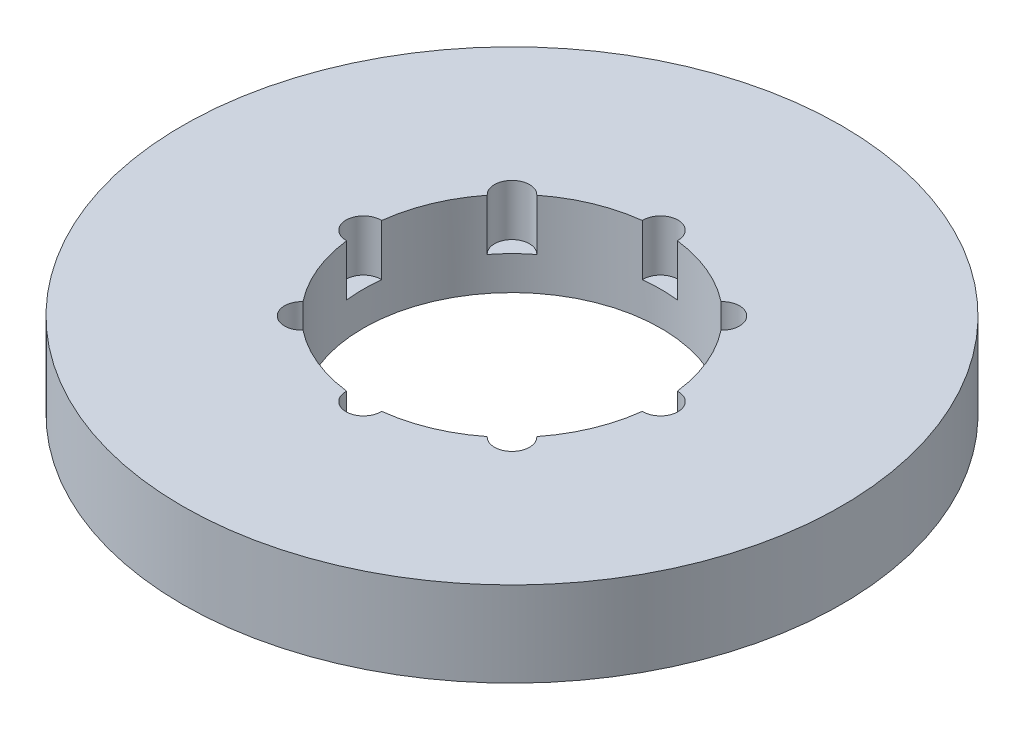
ISO-10303-21;
HEADER;
FILE_DESCRIPTION(('STEP AP214'),'2;1');
FILE_NAME('part.step','',(''),(''),'','','');
FILE_SCHEMA(('AUTOMOTIVE_DESIGN { 1 0 10303 214 1 1 1 1 }'));
ENDSEC;
DATA;
#1=APPLICATION_CONTEXT('core data for automotive mechanical design processes');
#2=APPLICATION_PROTOCOL_DEFINITION('international standard','automotive_design',2000,#1);
#3=PRODUCT_CONTEXT('',#1,'mechanical');
#4=PRODUCT('Part','Part','',(#3));
#5=PRODUCT_RELATED_PRODUCT_CATEGORY('part','',(#4));
#6=PRODUCT_DEFINITION_FORMATION('','',#4);
#7=PRODUCT_DEFINITION_CONTEXT('part definition',#1,'design');
#8=PRODUCT_DEFINITION('design','',#6,#7);
#9=PRODUCT_DEFINITION_SHAPE('','',#8);
#10=(LENGTH_UNIT() NAMED_UNIT(*) SI_UNIT(.MILLI.,.METRE.));
#11=(NAMED_UNIT(*) PLANE_ANGLE_UNIT() SI_UNIT($,.RADIAN.));
#12=(NAMED_UNIT(*) SI_UNIT($,.STERADIAN.) SOLID_ANGLE_UNIT());
#13=UNCERTAINTY_MEASURE_WITH_UNIT(LENGTH_MEASURE(1.E-05),#10,'distance_accuracy_value','');
#14=(GEOMETRIC_REPRESENTATION_CONTEXT(3) GLOBAL_UNCERTAINTY_ASSIGNED_CONTEXT((#13)) GLOBAL_UNIT_ASSIGNED_CONTEXT((#10,
#11,#12)) REPRESENTATION_CONTEXT('',''));
#15=CARTESIAN_POINT('',(0.,0.,0.));
#16=DIRECTION('',(0.,0.,1.));
#17=DIRECTION('',(1.,0.,0.));
#18=AXIS2_PLACEMENT_3D('',#15,#16,#17);
#19=CARTESIAN_POINT('',(0.,20.,0.));
#20=DIRECTION('',(0.,-1.,0.));
#21=DIRECTION('',(0.,0.,-1.));
#22=AXIS2_PLACEMENT_3D('',#19,#20,#21);
#23=CYLINDRICAL_SURFACE('',#22,77.5);
#24=CARTESIAN_POINT('',(0.,20.,0.));
#25=DIRECTION('',(0.,1.,0.));
#26=DIRECTION('',(0.,0.,1.));
#27=AXIS2_PLACEMENT_3D('',#24,#25,#26);
#28=CIRCLE('',#27,77.5);
#29=CARTESIAN_POINT('',(0.,20.,77.5));
#30=VERTEX_POINT('',#29);
#31=EDGE_CURVE('E195',#30,#30,#28,.T.);
#32=ORIENTED_EDGE('',*,*,#31,.F.);
#33=EDGE_LOOP('',(#32));
#34=FACE_BOUND('',#33,.T.);
#35=CARTESIAN_POINT('',(0.,0.,0.));
#36=DIRECTION('',(0.,1.,0.));
#37=DIRECTION('',(0.,0.,1.));
#38=AXIS2_PLACEMENT_3D('',#35,#36,#37);
#39=CIRCLE('',#38,77.5);
#40=CARTESIAN_POINT('',(0.,0.,77.5));
#41=VERTEX_POINT('',#40);
#42=EDGE_CURVE('E179',#41,#41,#39,.T.);
#43=ORIENTED_EDGE('',*,*,#42,.T.);
#44=EDGE_LOOP('',(#43));
#45=FACE_BOUND('',#44,.T.);
#46=ADVANCED_FACE('F39',(#34,#45),#23,.T.);
#47=CARTESIAN_POINT('',(0.,20.,0.));
#48=DIRECTION('',(0.,1.,0.));
#49=DIRECTION('',(0.,0.,1.));
#50=AXIS2_PLACEMENT_3D('',#47,#48,#49);
#51=PLANE('',#50);
#52=CARTESIAN_POINT('',(1.21893159481302E-13,20.,34.9115884210025));
#53=DIRECTION('',(0.,1.,0.));
#54=DIRECTION('',(1.,0.,0.));
#55=AXIS2_PLACEMENT_3D('',#52,#53,#54);
#56=CIRCLE('',#55,4.1246227369542);
#57=CARTESIAN_POINT('',(-4.12170451082952,20.,34.7564605782207));
#58=VERTEX_POINT('',#57);
#59=CARTESIAN_POINT('',(4.12170451082976,20.,34.7564605782207));
#60=VERTEX_POINT('',#59);
#61=EDGE_CURVE('E176',#58,#60,#56,.T.);
#62=ORIENTED_EDGE('',*,*,#61,.F.);
#63=CARTESIAN_POINT('',(0.,20.,0.));
#64=DIRECTION('',(0.,1.,0.));
#65=DIRECTION('',(0.,0.,1.));
#66=AXIS2_PLACEMENT_3D('',#63,#64,#65);
#67=CIRCLE('',#66,35.);
#68=CARTESIAN_POINT('',(-21.6620437552479,20.,27.4910141745576));
#69=VERTEX_POINT('',#68);
#70=EDGE_CURVE('E166',#69,#58,#67,.T.);
#71=ORIENTED_EDGE('',*,*,#70,.F.);
#72=CARTESIAN_POINT('',(-24.6862209144846,20.,24.6862209144847));
#73=DIRECTION('',(0.,1.,0.));
#74=DIRECTION('',(0.707106781186549,0.,0.707106781186546));
#75=AXIS2_PLACEMENT_3D('',#72,#73,#74);
#76=CIRCLE('',#75,4.1246227369542);
#77=CARTESIAN_POINT('',(-27.4910141745575,20.,21.662043755248));
#78=VERTEX_POINT('',#77);
#79=EDGE_CURVE('E147',#78,#69,#76,.T.);
#80=ORIENTED_EDGE('',*,*,#79,.F.);
#81=CARTESIAN_POINT('',(-34.7564605782207,20.,4.12170451082964));
#82=VERTEX_POINT('',#81);
#83=EDGE_CURVE('E180',#82,#78,#67,.T.);
#84=ORIENTED_EDGE('',*,*,#83,.F.);
#85=CARTESIAN_POINT('',(-34.9115884210025,20.,0.));
#86=DIRECTION('',(0.,1.,0.));
#87=DIRECTION('',(0.,0.,1.));
#88=AXIS2_PLACEMENT_3D('',#85,#86,#87);
#89=CIRCLE('',#88,4.1246227369542);
#90=CARTESIAN_POINT('',(-34.7564605782207,20.,-4.12170451082964));
#91=VERTEX_POINT('',#90);
#92=EDGE_CURVE('E186',#91,#82,#89,.T.);
#93=ORIENTED_EDGE('',*,*,#92,.F.);
#94=CARTESIAN_POINT('',(-27.4910141745578,20.,-21.6620437552476));
#95=VERTEX_POINT('',#94);
#96=EDGE_CURVE('E182',#95,#91,#67,.T.);
#97=ORIENTED_EDGE('',*,*,#96,.F.);
#98=CARTESIAN_POINT('',(-24.6862209144849,20.,-24.6862209144843));
#99=DIRECTION('',(0.,1.,0.));
#100=DIRECTION('',(-0.707106781186539,0.,0.707106781186556));
#101=AXIS2_PLACEMENT_3D('',#98,#99,#100);
#102=CIRCLE('',#101,4.1246227369542);
#103=CARTESIAN_POINT('',(-21.6620437552483,20.,-27.4910141745573));
#104=VERTEX_POINT('',#103);
#105=EDGE_CURVE('E446',#104,#95,#102,.T.);
#106=ORIENTED_EDGE('',*,*,#105,.F.);
#107=CARTESIAN_POINT('',(-4.12170451083001,20.,-34.7564605782206));
#108=VERTEX_POINT('',#107);
#109=EDGE_CURVE('E452',#108,#104,#67,.T.);
#110=ORIENTED_EDGE('',*,*,#109,.F.);
#111=CARTESIAN_POINT('',(-3.65679478443907E-13,20.,-34.9115884210025));
#112=DIRECTION('',(0.,1.,0.));
#113=DIRECTION('',(-1.,0.,0.));
#114=AXIS2_PLACEMENT_3D('',#111,#112,#113);
#115=CIRCLE('',#114,4.1246227369542);
#116=CARTESIAN_POINT('',(4.12170451082928,20.,-34.7564605782207));
#117=VERTEX_POINT('',#116);
#118=EDGE_CURVE('E477',#117,#108,#115,.T.);
#119=ORIENTED_EDGE('',*,*,#118,.F.);
#120=CARTESIAN_POINT('',(21.6620437552477,20.,-27.4910141745578));
#121=VERTEX_POINT('',#120);
#122=EDGE_CURVE('E460',#121,#117,#67,.T.);
#123=ORIENTED_EDGE('',*,*,#122,.F.);
#124=CARTESIAN_POINT('',(24.6862209144844,20.,-24.6862209144848));
#125=DIRECTION('',(0.,1.,0.));
#126=DIRECTION('',(-0.707106781186554,0.,-0.707106781186541));
#127=AXIS2_PLACEMENT_3D('',#124,#125,#126);
#128=CIRCLE('',#127,4.1246227369542);
#129=CARTESIAN_POINT('',(27.4910141745574,20.,-21.6620437552482));
#130=VERTEX_POINT('',#129);
#131=EDGE_CURVE('E464',#130,#121,#128,.T.);
#132=ORIENTED_EDGE('',*,*,#131,.F.);
#133=CARTESIAN_POINT('',(34.7564605782207,20.,-4.12170451082964));
#134=VERTEX_POINT('',#133);
#135=EDGE_CURVE('E459',#134,#130,#67,.T.);
#136=ORIENTED_EDGE('',*,*,#135,.F.);
#137=CARTESIAN_POINT('',(34.9115884210025,20.,0.));
#138=DIRECTION('',(0.,1.,0.));
#139=DIRECTION('',(0.,0.,-1.));
#140=AXIS2_PLACEMENT_3D('',#137,#138,#139);
#141=CIRCLE('',#140,4.1246227369542);
#142=CARTESIAN_POINT('',(34.7564605782207,20.,4.12170451082964));
#143=VERTEX_POINT('',#142);
#144=EDGE_CURVE('E469',#143,#134,#141,.T.);
#145=ORIENTED_EDGE('',*,*,#144,.F.);
#146=CARTESIAN_POINT('',(27.4910141745577,20.,21.6620437552478));
#147=VERTEX_POINT('',#146);
#148=EDGE_CURVE('E181',#147,#143,#67,.T.);
#149=ORIENTED_EDGE('',*,*,#148,.F.);
#150=CARTESIAN_POINT('',(24.6862209144847,20.,24.6862209144845));
#151=DIRECTION('',(0.,1.,0.));
#152=DIRECTION('',(0.707106781186544,0.,-0.707106781186551));
#153=AXIS2_PLACEMENT_3D('',#150,#151,#152);
#154=CIRCLE('',#153,4.1246227369542);
#155=CARTESIAN_POINT('',(21.6620437552481,20.,27.4910141745575));
#156=VERTEX_POINT('',#155);
#157=EDGE_CURVE('E475',#156,#147,#154,.T.);
#158=ORIENTED_EDGE('',*,*,#157,.F.);
#159=EDGE_CURVE('E177',#60,#156,#67,.T.);
#160=ORIENTED_EDGE('',*,*,#159,.F.);
#161=EDGE_LOOP('',(#62,#71,#80,#84,#93,#97,#106,#110,#119,#123,#132,#136,#145,#149,#158,#160));
#162=FACE_BOUND('',#161,.T.);
#163=ORIENTED_EDGE('',*,*,#31,.T.);
#164=EDGE_LOOP('',(#163));
#165=FACE_BOUND('',#164,.T.);
#166=ADVANCED_FACE('F172',(#162,#165),#51,.T.);
#167=CARTESIAN_POINT('',(0.,0.,0.));
#168=DIRECTION('',(0.,1.,0.));
#169=DIRECTION('',(0.,0.,1.));
#170=AXIS2_PLACEMENT_3D('',#167,#168,#169);
#171=PLANE('',#170);
#172=CARTESIAN_POINT('',(0.,0.,0.));
#173=DIRECTION('',(0.,1.,0.));
#174=DIRECTION('',(0.,0.,1.));
#175=AXIS2_PLACEMENT_3D('',#172,#173,#174);
#176=CIRCLE('',#175,35.);
#177=CARTESIAN_POINT('',(0.,0.,35.));
#178=VERTEX_POINT('',#177);
#179=EDGE_CURVE('E187',#178,#178,#176,.T.);
#180=ORIENTED_EDGE('',*,*,#179,.T.);
#181=EDGE_LOOP('',(#180));
#182=FACE_BOUND('',#181,.T.);
#183=ORIENTED_EDGE('',*,*,#42,.F.);
#184=EDGE_LOOP('',(#183));
#185=FACE_BOUND('',#184,.T.);
#186=ADVANCED_FACE('F270',(#182,#185),#171,.F.);
#187=CARTESIAN_POINT('',(0.,20.,0.));
#188=DIRECTION('',(0.,-1.,0.));
#189=DIRECTION('',(0.,0.,-1.));
#190=AXIS2_PLACEMENT_3D('',#187,#188,#189);
#191=CYLINDRICAL_SURFACE('',#190,35.);
#192=DIRECTION('',(0.,1.,0.));
#193=VECTOR('',#192,1.);
#194=CARTESIAN_POINT('',(-4.12170451082952,13.9682548965956,34.7564605782207));
#195=LINE('',#194,#193);
#196=CARTESIAN_POINT('',(-4.12170451082952,7.93650979319126,34.7564605782207));
#197=VERTEX_POINT('',#196);
#198=EDGE_CURVE('E11',#197,#58,#195,.T.);
#199=ORIENTED_EDGE('',*,*,#198,.F.);
#200=CARTESIAN_POINT('',(0.,7.93650979319126,0.));
#201=DIRECTION('',(0.,1.,0.));
#202=DIRECTION('',(0.,0.,1.));
#203=AXIS2_PLACEMENT_3D('',#200,#201,#202);
#204=CIRCLE('',#203,35.);
#205=CARTESIAN_POINT('',(4.12170451082976,7.93650979319126,34.7564605782207));
#206=VERTEX_POINT('',#205);
#207=EDGE_CURVE('E250',#197,#206,#204,.T.);
#208=ORIENTED_EDGE('',*,*,#207,.T.);
#209=DIRECTION('',(0.,1.,0.));
#210=VECTOR('',#209,1.);
#211=CARTESIAN_POINT('',(4.12170451082976,13.9682548965956,34.7564605782207));
#212=LINE('',#211,#210);
#213=EDGE_CURVE('E46',#60,#206,#212,.F.);
#214=ORIENTED_EDGE('',*,*,#213,.F.);
#215=ORIENTED_EDGE('',*,*,#159,.T.);
#216=DIRECTION('',(0.,1.,0.));
#217=VECTOR('',#216,1.);
#218=CARTESIAN_POINT('',(21.6620437552481,13.9682548965956,27.4910141745575));
#219=LINE('',#218,#217);
#220=CARTESIAN_POINT('',(21.6620437552481,7.93650979319126,27.4910141745575));
#221=VERTEX_POINT('',#220);
#222=EDGE_CURVE('E244',#221,#156,#219,.T.);
#223=ORIENTED_EDGE('',*,*,#222,.F.);
#224=CARTESIAN_POINT('',(0.,7.93650979319126,0.));
#225=DIRECTION('',(0.,1.,0.));
#226=DIRECTION('',(0.,0.,1.));
#227=AXIS2_PLACEMENT_3D('',#224,#225,#226);
#228=CIRCLE('',#227,35.);
#229=CARTESIAN_POINT('',(27.4910141745577,7.93650979319126,21.6620437552478));
#230=VERTEX_POINT('',#229);
#231=EDGE_CURVE('E238',#221,#230,#228,.T.);
#232=ORIENTED_EDGE('',*,*,#231,.T.);
#233=DIRECTION('',(0.,1.,0.));
#234=VECTOR('',#233,1.);
#235=CARTESIAN_POINT('',(27.4910141745577,13.9682548965956,21.6620437552478));
#236=LINE('',#235,#234);
#237=EDGE_CURVE('E242',#147,#230,#236,.F.);
#238=ORIENTED_EDGE('',*,*,#237,.F.);
#239=ORIENTED_EDGE('',*,*,#148,.T.);
#240=DIRECTION('',(0.,1.,0.));
#241=VECTOR('',#240,1.);
#242=CARTESIAN_POINT('',(34.7564605782207,13.9682548965956,4.12170451082964));
#243=LINE('',#242,#241);
#244=CARTESIAN_POINT('',(34.7564605782207,7.93650979319126,4.12170451082964));
#245=VERTEX_POINT('',#244);
#246=EDGE_CURVE('E236',#245,#143,#243,.T.);
#247=ORIENTED_EDGE('',*,*,#246,.F.);
#248=CARTESIAN_POINT('',(0.,7.93650979319126,0.));
#249=DIRECTION('',(0.,1.,0.));
#250=DIRECTION('',(0.,0.,1.));
#251=AXIS2_PLACEMENT_3D('',#248,#249,#250);
#252=CIRCLE('',#251,35.);
#253=CARTESIAN_POINT('',(34.7564605782207,7.93650979319126,-4.12170451082964));
#254=VERTEX_POINT('',#253);
#255=EDGE_CURVE('E235',#245,#254,#252,.T.);
#256=ORIENTED_EDGE('',*,*,#255,.T.);
#257=DIRECTION('',(0.,1.,0.));
#258=VECTOR('',#257,1.);
#259=CARTESIAN_POINT('',(34.7564605782207,13.9682548965956,-4.12170451082964));
#260=LINE('',#259,#258);
#261=EDGE_CURVE('E234',#134,#254,#260,.F.);
#262=ORIENTED_EDGE('',*,*,#261,.F.);
#263=ORIENTED_EDGE('',*,*,#135,.T.);
#264=DIRECTION('',(0.,1.,0.));
#265=VECTOR('',#264,1.);
#266=CARTESIAN_POINT('',(27.4910141745574,13.9682548965956,-21.6620437552482));
#267=LINE('',#266,#265);
#268=CARTESIAN_POINT('',(27.4910141745574,7.93650979319126,-21.6620437552482));
#269=VERTEX_POINT('',#268);
#270=EDGE_CURVE('E229',#269,#130,#267,.T.);
#271=ORIENTED_EDGE('',*,*,#270,.F.);
#272=CARTESIAN_POINT('',(0.,7.93650979319126,0.));
#273=DIRECTION('',(0.,1.,0.));
#274=DIRECTION('',(0.,0.,1.));
#275=AXIS2_PLACEMENT_3D('',#272,#273,#274);
#276=CIRCLE('',#275,35.);
#277=CARTESIAN_POINT('',(21.6620437552477,7.93650979319126,-27.4910141745578));
#278=VERTEX_POINT('',#277);
#279=EDGE_CURVE('E221',#269,#278,#276,.T.);
#280=ORIENTED_EDGE('',*,*,#279,.T.);
#281=DIRECTION('',(0.,1.,0.));
#282=VECTOR('',#281,1.);
#283=CARTESIAN_POINT('',(21.6620437552477,13.9682548965956,-27.4910141745578));
#284=LINE('',#283,#282);
#285=EDGE_CURVE('E230',#121,#278,#284,.F.);
#286=ORIENTED_EDGE('',*,*,#285,.F.);
#287=ORIENTED_EDGE('',*,*,#122,.T.);
#288=DIRECTION('',(0.,1.,0.));
#289=VECTOR('',#288,1.);
#290=CARTESIAN_POINT('',(4.12170451082928,13.9682548965956,-34.7564605782207));
#291=LINE('',#290,#289);
#292=CARTESIAN_POINT('',(4.12170451082928,7.93650979319126,-34.7564605782207));
#293=VERTEX_POINT('',#292);
#294=EDGE_CURVE('E225',#293,#117,#291,.T.);
#295=ORIENTED_EDGE('',*,*,#294,.F.);
#296=CARTESIAN_POINT('',(0.,7.93650979319126,0.));
#297=DIRECTION('',(0.,1.,0.));
#298=DIRECTION('',(0.,0.,1.));
#299=AXIS2_PLACEMENT_3D('',#296,#297,#298);
#300=CIRCLE('',#299,35.);
#301=CARTESIAN_POINT('',(-4.12170451083001,7.93650979319126,-34.7564605782206));
#302=VERTEX_POINT('',#301);
#303=EDGE_CURVE('E216',#293,#302,#300,.T.);
#304=ORIENTED_EDGE('',*,*,#303,.T.);
#305=DIRECTION('',(0.,1.,0.));
#306=VECTOR('',#305,1.);
#307=CARTESIAN_POINT('',(-4.12170451083001,13.9682548965956,-34.7564605782206));
#308=LINE('',#307,#306);
#309=EDGE_CURVE('E218',#108,#302,#308,.F.);
#310=ORIENTED_EDGE('',*,*,#309,.F.);
#311=ORIENTED_EDGE('',*,*,#109,.T.);
#312=DIRECTION('',(0.,1.,0.));
#313=VECTOR('',#312,1.);
#314=CARTESIAN_POINT('',(-21.6620437552483,13.9682548965956,-27.4910141745573));
#315=LINE('',#314,#313);
#316=CARTESIAN_POINT('',(-21.6620437552483,7.93650979319126,-27.4910141745573));
#317=VERTEX_POINT('',#316);
#318=EDGE_CURVE('E212',#317,#104,#315,.T.);
#319=ORIENTED_EDGE('',*,*,#318,.F.);
#320=CARTESIAN_POINT('',(0.,7.93650979319126,0.));
#321=DIRECTION('',(0.,1.,0.));
#322=DIRECTION('',(0.,0.,1.));
#323=AXIS2_PLACEMENT_3D('',#320,#321,#322);
#324=CIRCLE('',#323,35.);
#325=CARTESIAN_POINT('',(-27.4910141745578,7.93650979319126,-21.6620437552476));
#326=VERTEX_POINT('',#325);
#327=EDGE_CURVE('E208',#317,#326,#324,.T.);
#328=ORIENTED_EDGE('',*,*,#327,.T.);
#329=DIRECTION('',(0.,1.,0.));
#330=VECTOR('',#329,1.);
#331=CARTESIAN_POINT('',(-27.4910141745578,13.9682548965956,-21.6620437552476));
#332=LINE('',#331,#330);
#333=EDGE_CURVE('E211',#95,#326,#332,.F.);
#334=ORIENTED_EDGE('',*,*,#333,.F.);
#335=ORIENTED_EDGE('',*,*,#96,.T.);
#336=DIRECTION('',(0.,1.,0.));
#337=VECTOR('',#336,1.);
#338=CARTESIAN_POINT('',(-34.7564605782207,13.9682548965956,-4.12170451082964));
#339=LINE('',#338,#337);
#340=CARTESIAN_POINT('',(-34.7564605782207,7.93650979319126,-4.12170451082964));
#341=VERTEX_POINT('',#340);
#342=EDGE_CURVE('E201',#341,#91,#339,.T.);
#343=ORIENTED_EDGE('',*,*,#342,.F.);
#344=CARTESIAN_POINT('',(0.,7.93650979319126,0.));
#345=DIRECTION('',(0.,1.,0.));
#346=DIRECTION('',(0.,0.,1.));
#347=AXIS2_PLACEMENT_3D('',#344,#345,#346);
#348=CIRCLE('',#347,35.);
#349=CARTESIAN_POINT('',(-34.7564605782207,7.93650979319126,4.12170451082964));
#350=VERTEX_POINT('',#349);
#351=EDGE_CURVE('E194',#341,#350,#348,.T.);
#352=ORIENTED_EDGE('',*,*,#351,.T.);
#353=DIRECTION('',(0.,1.,0.));
#354=VECTOR('',#353,1.);
#355=CARTESIAN_POINT('',(-34.7564605782207,13.9682548965956,4.12170451082964));
#356=LINE('',#355,#354);
#357=EDGE_CURVE('E199',#82,#350,#356,.F.);
#358=ORIENTED_EDGE('',*,*,#357,.F.);
#359=ORIENTED_EDGE('',*,*,#83,.T.);
#360=DIRECTION('',(0.,1.,0.));
#361=VECTOR('',#360,1.);
#362=CARTESIAN_POINT('',(-27.4910141745575,13.9682548965956,21.662043755248));
#363=LINE('',#362,#361);
#364=CARTESIAN_POINT('',(-27.4910141745575,7.93650979319126,21.662043755248));
#365=VERTEX_POINT('',#364);
#366=EDGE_CURVE('E160',#365,#78,#363,.T.);
#367=ORIENTED_EDGE('',*,*,#366,.F.);
#368=CARTESIAN_POINT('',(0.,7.93650979319126,0.));
#369=DIRECTION('',(0.,1.,0.));
#370=DIRECTION('',(0.,0.,1.));
#371=AXIS2_PLACEMENT_3D('',#368,#369,#370);
#372=CIRCLE('',#371,35.);
#373=CARTESIAN_POINT('',(-21.6620437552479,7.93650979319126,27.4910141745576));
#374=VERTEX_POINT('',#373);
#375=EDGE_CURVE('E168',#365,#374,#372,.T.);
#376=ORIENTED_EDGE('',*,*,#375,.T.);
#377=DIRECTION('',(0.,1.,0.));
#378=VECTOR('',#377,1.);
#379=CARTESIAN_POINT('',(-21.6620437552479,13.9682548965956,27.4910141745576));
#380=LINE('',#379,#378);
#381=EDGE_CURVE('E152',#69,#374,#380,.F.);
#382=ORIENTED_EDGE('',*,*,#381,.F.);
#383=ORIENTED_EDGE('',*,*,#70,.T.);
#384=EDGE_LOOP('',(#199,#208,#214,#215,#223,#232,#238,#239,#247,#256,#262,#263,#271,#280,#286,
#287,#295,#304,#310,#311,#319,#328,#334,#335,#343,#352,#358,#359,#367,#376,#382,#383));
#385=FACE_BOUND('',#384,.T.);
#386=ORIENTED_EDGE('',*,*,#179,.F.);
#387=EDGE_LOOP('',(#386));
#388=FACE_BOUND('',#387,.T.);
#389=ADVANCED_FACE('F170',(#385,#388),#191,.F.);
#390=CARTESIAN_POINT('',(-34.9115884210025,7.93650979319126,0.));
#391=DIRECTION('',(0.,1.,0.));
#392=DIRECTION('',(0.,0.,1.));
#393=AXIS2_PLACEMENT_3D('',#390,#391,#392);
#394=CYLINDRICAL_SURFACE('',#393,4.1246227369542);
#395=ORIENTED_EDGE('',*,*,#342,.T.);
#396=ORIENTED_EDGE('',*,*,#92,.T.);
#397=ORIENTED_EDGE('',*,*,#357,.T.);
#398=CARTESIAN_POINT('',(-34.9115884210025,7.93650979319126,0.));
#399=DIRECTION('',(0.,1.,0.));
#400=DIRECTION('',(0.,0.,1.));
#401=AXIS2_PLACEMENT_3D('',#398,#399,#400);
#402=CIRCLE('',#401,4.1246227369542);
#403=EDGE_CURVE('E191',#341,#350,#402,.T.);
#404=ORIENTED_EDGE('',*,*,#403,.F.);
#405=EDGE_LOOP('',(#395,#396,#397,#404));
#406=FACE_BOUND('',#405,.T.);
#407=ADVANCED_FACE('F279',(#406),#394,.F.);
#408=CARTESIAN_POINT('',(-34.9115884210025,7.93650979319126,0.));
#409=DIRECTION('',(0.,1.,0.));
#410=DIRECTION('',(0.,0.,1.));
#411=AXIS2_PLACEMENT_3D('',#408,#409,#410);
#412=PLANE('',#411);
#413=ORIENTED_EDGE('',*,*,#403,.T.);
#414=ORIENTED_EDGE('',*,*,#351,.F.);
#415=EDGE_LOOP('',(#413,#414));
#416=FACE_BOUND('',#415,.T.);
#417=ADVANCED_FACE('F285',(#416),#412,.T.);
#418=CARTESIAN_POINT('',(-24.6862209144846,7.93650979319126,24.6862209144847));
#419=DIRECTION('',(0.,1.,0.));
#420=DIRECTION('',(0.,0.,1.));
#421=AXIS2_PLACEMENT_3D('',#418,#419,#420);
#422=CYLINDRICAL_SURFACE('',#421,4.1246227369542);
#423=ORIENTED_EDGE('',*,*,#366,.T.);
#424=ORIENTED_EDGE('',*,*,#79,.T.);
#425=ORIENTED_EDGE('',*,*,#381,.T.);
#426=CARTESIAN_POINT('',(-24.6862209144846,7.93650979319126,24.6862209144847));
#427=DIRECTION('',(0.,1.,0.));
#428=DIRECTION('',(0.707106781186549,0.,0.707106781186546));
#429=AXIS2_PLACEMENT_3D('',#426,#427,#428);
#430=CIRCLE('',#429,4.1246227369542);
#431=EDGE_CURVE('E165',#365,#374,#430,.T.);
#432=ORIENTED_EDGE('',*,*,#431,.F.);
#433=EDGE_LOOP('',(#423,#424,#425,#432));
#434=FACE_BOUND('',#433,.T.);
#435=ADVANCED_FACE('F155',(#434),#422,.F.);
#436=CARTESIAN_POINT('',(-24.6862209144846,7.93650979319126,24.6862209144847));
#437=DIRECTION('',(0.,1.,0.));
#438=DIRECTION('',(0.707106781186549,0.,0.707106781186546));
#439=AXIS2_PLACEMENT_3D('',#436,#437,#438);
#440=PLANE('',#439);
#441=ORIENTED_EDGE('',*,*,#431,.T.);
#442=ORIENTED_EDGE('',*,*,#375,.F.);
#443=EDGE_LOOP('',(#441,#442));
#444=FACE_BOUND('',#443,.T.);
#445=ADVANCED_FACE('F288',(#444),#440,.T.);
#446=CARTESIAN_POINT('',(-24.6862209144849,7.93650979319126,-24.6862209144843));
#447=DIRECTION('',(0.,1.,0.));
#448=DIRECTION('',(0.,0.,1.));
#449=AXIS2_PLACEMENT_3D('',#446,#447,#448);
#450=CYLINDRICAL_SURFACE('',#449,4.1246227369542);
#451=ORIENTED_EDGE('',*,*,#318,.T.);
#452=ORIENTED_EDGE('',*,*,#105,.T.);
#453=ORIENTED_EDGE('',*,*,#333,.T.);
#454=CARTESIAN_POINT('',(-24.6862209144849,7.93650979319126,-24.6862209144843));
#455=DIRECTION('',(0.,1.,0.));
#456=DIRECTION('',(-0.707106781186539,0.,0.707106781186556));
#457=AXIS2_PLACEMENT_3D('',#454,#455,#456);
#458=CIRCLE('',#457,4.1246227369542);
#459=EDGE_CURVE('E447',#317,#326,#458,.T.);
#460=ORIENTED_EDGE('',*,*,#459,.F.);
#461=EDGE_LOOP('',(#451,#452,#453,#460));
#462=FACE_BOUND('',#461,.T.);
#463=ADVANCED_FACE('F295',(#462),#450,.F.);
#464=CARTESIAN_POINT('',(-24.6862209144849,7.93650979319126,-24.6862209144843));
#465=DIRECTION('',(0.,1.,0.));
#466=DIRECTION('',(-0.707106781186539,0.,0.707106781186556));
#467=AXIS2_PLACEMENT_3D('',#464,#465,#466);
#468=PLANE('',#467);
#469=ORIENTED_EDGE('',*,*,#459,.T.);
#470=ORIENTED_EDGE('',*,*,#327,.F.);
#471=EDGE_LOOP('',(#469,#470));
#472=FACE_BOUND('',#471,.T.);
#473=ADVANCED_FACE('F375',(#472),#468,.T.);
#474=CARTESIAN_POINT('',(-3.65679478443907E-13,7.93650979319126,-34.9115884210025));
#475=DIRECTION('',(0.,1.,0.));
#476=DIRECTION('',(0.,0.,1.));
#477=AXIS2_PLACEMENT_3D('',#474,#475,#476);
#478=CYLINDRICAL_SURFACE('',#477,4.1246227369542);
#479=ORIENTED_EDGE('',*,*,#294,.T.);
#480=ORIENTED_EDGE('',*,*,#118,.T.);
#481=ORIENTED_EDGE('',*,*,#309,.T.);
#482=CARTESIAN_POINT('',(-3.65679478443907E-13,7.93650979319126,-34.9115884210025));
#483=DIRECTION('',(0.,1.,0.));
#484=DIRECTION('',(-1.,0.,0.));
#485=AXIS2_PLACEMENT_3D('',#482,#483,#484);
#486=CIRCLE('',#485,4.1246227369542);
#487=EDGE_CURVE('E467',#293,#302,#486,.T.);
#488=ORIENTED_EDGE('',*,*,#487,.F.);
#489=EDGE_LOOP('',(#479,#480,#481,#488));
#490=FACE_BOUND('',#489,.T.);
#491=ADVANCED_FACE('F361',(#490),#478,.F.);
#492=CARTESIAN_POINT('',(-3.65679478443907E-13,7.93650979319126,-34.9115884210025));
#493=DIRECTION('',(0.,1.,0.));
#494=DIRECTION('',(-1.,0.,0.));
#495=AXIS2_PLACEMENT_3D('',#492,#493,#494);
#496=PLANE('',#495);
#497=ORIENTED_EDGE('',*,*,#487,.T.);
#498=ORIENTED_EDGE('',*,*,#303,.F.);
#499=EDGE_LOOP('',(#497,#498));
#500=FACE_BOUND('',#499,.T.);
#501=ADVANCED_FACE('F297',(#500),#496,.T.);
#502=CARTESIAN_POINT('',(24.6862209144844,7.93650979319126,-24.6862209144848));
#503=DIRECTION('',(0.,1.,0.));
#504=DIRECTION('',(0.,0.,1.));
#505=AXIS2_PLACEMENT_3D('',#502,#503,#504);
#506=CYLINDRICAL_SURFACE('',#505,4.1246227369542);
#507=ORIENTED_EDGE('',*,*,#270,.T.);
#508=ORIENTED_EDGE('',*,*,#131,.T.);
#509=ORIENTED_EDGE('',*,*,#285,.T.);
#510=CARTESIAN_POINT('',(24.6862209144844,7.93650979319126,-24.6862209144848));
#511=DIRECTION('',(0.,1.,0.));
#512=DIRECTION('',(-0.707106781186554,0.,-0.707106781186541));
#513=AXIS2_PLACEMENT_3D('',#510,#511,#512);
#514=CIRCLE('',#513,4.1246227369542);
#515=EDGE_CURVE('E470',#269,#278,#514,.T.);
#516=ORIENTED_EDGE('',*,*,#515,.F.);
#517=EDGE_LOOP('',(#507,#508,#509,#516));
#518=FACE_BOUND('',#517,.T.);
#519=ADVANCED_FACE('F294',(#518),#506,.F.);
#520=CARTESIAN_POINT('',(24.6862209144844,7.93650979319126,-24.6862209144848));
#521=DIRECTION('',(0.,1.,0.));
#522=DIRECTION('',(-0.707106781186554,0.,-0.707106781186541));
#523=AXIS2_PLACEMENT_3D('',#520,#521,#522);
#524=PLANE('',#523);
#525=ORIENTED_EDGE('',*,*,#515,.T.);
#526=ORIENTED_EDGE('',*,*,#279,.F.);
#527=EDGE_LOOP('',(#525,#526));
#528=FACE_BOUND('',#527,.T.);
#529=ADVANCED_FACE('F300',(#528),#524,.T.);
#530=CARTESIAN_POINT('',(34.9115884210025,7.93650979319126,0.));
#531=DIRECTION('',(0.,1.,0.));
#532=DIRECTION('',(0.,0.,1.));
#533=AXIS2_PLACEMENT_3D('',#530,#531,#532);
#534=CYLINDRICAL_SURFACE('',#533,4.1246227369542);
#535=ORIENTED_EDGE('',*,*,#246,.T.);
#536=ORIENTED_EDGE('',*,*,#144,.T.);
#537=ORIENTED_EDGE('',*,*,#261,.T.);
#538=CARTESIAN_POINT('',(34.9115884210025,7.93650979319126,0.));
#539=DIRECTION('',(0.,1.,0.));
#540=DIRECTION('',(0.,0.,-1.));
#541=AXIS2_PLACEMENT_3D('',#538,#539,#540);
#542=CIRCLE('',#541,4.1246227369542);
#543=EDGE_CURVE('E472',#245,#254,#542,.T.);
#544=ORIENTED_EDGE('',*,*,#543,.F.);
#545=EDGE_LOOP('',(#535,#536,#537,#544));
#546=FACE_BOUND('',#545,.T.);
#547=ADVANCED_FACE('F305',(#546),#534,.F.);
#548=CARTESIAN_POINT('',(34.9115884210025,7.93650979319126,0.));
#549=DIRECTION('',(0.,1.,0.));
#550=DIRECTION('',(0.,0.,-1.));
#551=AXIS2_PLACEMENT_3D('',#548,#549,#550);
#552=PLANE('',#551);
#553=ORIENTED_EDGE('',*,*,#543,.T.);
#554=ORIENTED_EDGE('',*,*,#255,.F.);
#555=EDGE_LOOP('',(#553,#554));
#556=FACE_BOUND('',#555,.T.);
#557=ADVANCED_FACE('F308',(#556),#552,.T.);
#558=CARTESIAN_POINT('',(24.6862209144847,7.93650979319126,24.6862209144845));
#559=DIRECTION('',(0.,1.,0.));
#560=DIRECTION('',(0.,0.,1.));
#561=AXIS2_PLACEMENT_3D('',#558,#559,#560);
#562=CYLINDRICAL_SURFACE('',#561,4.1246227369542);
#563=ORIENTED_EDGE('',*,*,#222,.T.);
#564=ORIENTED_EDGE('',*,*,#157,.T.);
#565=ORIENTED_EDGE('',*,*,#237,.T.);
#566=CARTESIAN_POINT('',(24.6862209144847,7.93650979319126,24.6862209144845));
#567=DIRECTION('',(0.,1.,0.));
#568=DIRECTION('',(0.707106781186544,0.,-0.707106781186551));
#569=AXIS2_PLACEMENT_3D('',#566,#567,#568);
#570=CIRCLE('',#569,4.1246227369542);
#571=EDGE_CURVE('E56',#221,#230,#570,.T.);
#572=ORIENTED_EDGE('',*,*,#571,.F.);
#573=EDGE_LOOP('',(#563,#564,#565,#572));
#574=FACE_BOUND('',#573,.T.);
#575=ADVANCED_FACE('F309',(#574),#562,.F.);
#576=CARTESIAN_POINT('',(24.6862209144847,7.93650979319126,24.6862209144845));
#577=DIRECTION('',(0.,1.,0.));
#578=DIRECTION('',(0.707106781186544,0.,-0.707106781186551));
#579=AXIS2_PLACEMENT_3D('',#576,#577,#578);
#580=PLANE('',#579);
#581=ORIENTED_EDGE('',*,*,#571,.T.);
#582=ORIENTED_EDGE('',*,*,#231,.F.);
#583=EDGE_LOOP('',(#581,#582));
#584=FACE_BOUND('',#583,.T.);
#585=ADVANCED_FACE('F256',(#584),#580,.T.);
#586=CARTESIAN_POINT('',(1.21893159481302E-13,7.93650979319126,34.9115884210025));
#587=DIRECTION('',(0.,1.,0.));
#588=DIRECTION('',(0.,0.,1.));
#589=AXIS2_PLACEMENT_3D('',#586,#587,#588);
#590=CYLINDRICAL_SURFACE('',#589,4.1246227369542);
#591=ORIENTED_EDGE('',*,*,#198,.T.);
#592=ORIENTED_EDGE('',*,*,#61,.T.);
#593=ORIENTED_EDGE('',*,*,#213,.T.);
#594=CARTESIAN_POINT('',(1.21893159481302E-13,7.93650979319126,34.9115884210025));
#595=DIRECTION('',(0.,1.,0.));
#596=DIRECTION('',(1.,0.,0.));
#597=AXIS2_PLACEMENT_3D('',#594,#595,#596);
#598=CIRCLE('',#597,4.1246227369542);
#599=EDGE_CURVE('E55',#197,#206,#598,.T.);
#600=ORIENTED_EDGE('',*,*,#599,.F.);
#601=EDGE_LOOP('',(#591,#592,#593,#600));
#602=FACE_BOUND('',#601,.T.);
#603=ADVANCED_FACE('F253',(#602),#590,.F.);
#604=CARTESIAN_POINT('',(1.21893159481302E-13,7.93650979319126,34.9115884210025));
#605=DIRECTION('',(0.,1.,0.));
#606=DIRECTION('',(1.,0.,0.));
#607=AXIS2_PLACEMENT_3D('',#604,#605,#606);
#608=PLANE('',#607);
#609=ORIENTED_EDGE('',*,*,#599,.T.);
#610=ORIENTED_EDGE('',*,*,#207,.F.);
#611=EDGE_LOOP('',(#609,#610));
#612=FACE_BOUND('',#611,.T.);
#613=ADVANCED_FACE('F252',(#612),#608,.T.);
#614=CLOSED_SHELL('',(#46,#166,#186,#389,#407,#417,#435,#445,#463,#473,#491,#501,#519,#529,#547,
#557,#575,#585,#603,#613));
#615=MANIFOLD_SOLID_BREP('B2',#614);
#616=ADVANCED_BREP_SHAPE_REPRESENTATION('',(#18,#615),#14);
#617=SHAPE_DEFINITION_REPRESENTATION(#9,#616);
ENDSEC;
END-ISO-10303-21;
